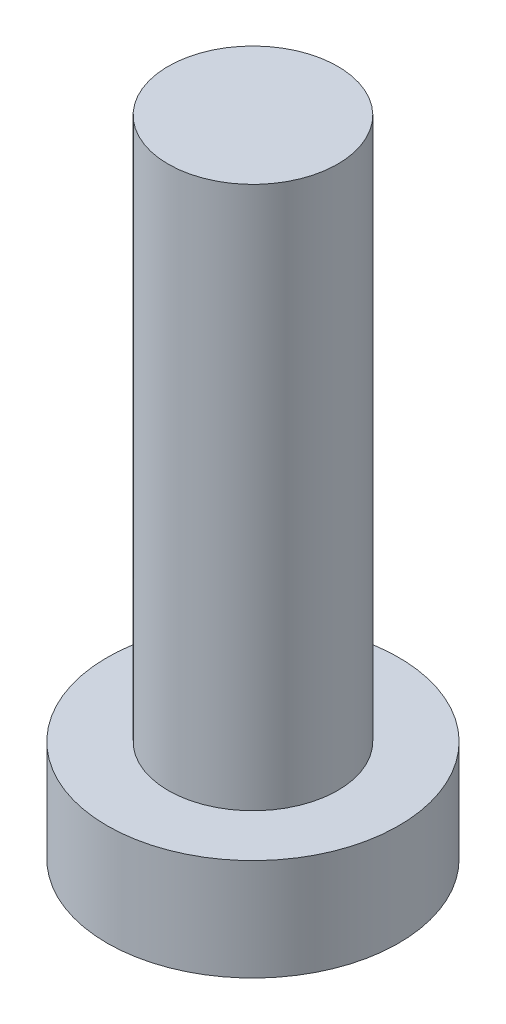
ISO-10303-21;
HEADER;
FILE_DESCRIPTION(('STEP AP214'),'2;1');
FILE_NAME('part.step','',(''),(''),'','','');
FILE_SCHEMA(('AUTOMOTIVE_DESIGN { 1 0 10303 214 1 1 1 1 }'));
ENDSEC;
DATA;
#1=APPLICATION_CONTEXT('core data for automotive mechanical design processes');
#2=APPLICATION_PROTOCOL_DEFINITION('international standard','automotive_design',2000,#1);
#3=PRODUCT_CONTEXT('',#1,'mechanical');
#4=PRODUCT('Part','Part','',(#3));
#5=PRODUCT_RELATED_PRODUCT_CATEGORY('part','',(#4));
#6=PRODUCT_DEFINITION_FORMATION('','',#4);
#7=PRODUCT_DEFINITION_CONTEXT('part definition',#1,'design');
#8=PRODUCT_DEFINITION('design','',#6,#7);
#9=PRODUCT_DEFINITION_SHAPE('','',#8);
#10=(LENGTH_UNIT() NAMED_UNIT(*) SI_UNIT(.MILLI.,.METRE.));
#11=(NAMED_UNIT(*) PLANE_ANGLE_UNIT() SI_UNIT($,.RADIAN.));
#12=(NAMED_UNIT(*) SI_UNIT($,.STERADIAN.) SOLID_ANGLE_UNIT());
#13=UNCERTAINTY_MEASURE_WITH_UNIT(LENGTH_MEASURE(1.E-05),#10,'distance_accuracy_value','');
#14=(GEOMETRIC_REPRESENTATION_CONTEXT(3) GLOBAL_UNCERTAINTY_ASSIGNED_CONTEXT((#13)) GLOBAL_UNIT_ASSIGNED_CONTEXT((#10,
#11,#12)) REPRESENTATION_CONTEXT('',''));
#15=CARTESIAN_POINT('',(0.,0.,0.));
#16=DIRECTION('',(0.,0.,1.));
#17=DIRECTION('',(1.,0.,0.));
#18=AXIS2_PLACEMENT_3D('',#15,#16,#17);
#19=CARTESIAN_POINT('',(0.,0.,0.));
#20=DIRECTION('',(0.,1.,0.));
#21=DIRECTION('',(0.,0.,1.));
#22=AXIS2_PLACEMENT_3D('',#19,#20,#21);
#23=PLANE('',#22);
#24=CARTESIAN_POINT('',(0.,0.,0.));
#25=DIRECTION('',(0.,1.,0.));
#26=DIRECTION('',(0.,0.,1.));
#27=AXIS2_PLACEMENT_3D('',#24,#25,#26);
#28=CIRCLE('',#27,4.3);
#29=CARTESIAN_POINT('',(0.,0.,4.3));
#30=VERTEX_POINT('',#29);
#31=EDGE_CURVE('E39',#30,#30,#28,.T.);
#32=ORIENTED_EDGE('',*,*,#31,.F.);
#33=EDGE_LOOP('',(#32));
#34=FACE_BOUND('',#33,.T.);
#35=CARTESIAN_POINT('',(1.1,0.,1.1));
#36=DIRECTION('',(0.,1.,0.));
#37=DIRECTION('',(0.,0.,-1.));
#38=AXIS2_PLACEMENT_3D('',#35,#36,#37);
#39=CIRCLE('',#38,0.5);
#40=CARTESIAN_POINT('',(1.1,0.,0.6));
#41=VERTEX_POINT('',#40);
#42=CARTESIAN_POINT('',(0.6,0.,1.1));
#43=VERTEX_POINT('',#42);
#44=EDGE_CURVE('E186',#41,#43,#39,.T.);
#45=ORIENTED_EDGE('',*,*,#44,.F.);
#46=DIRECTION('',(-1.,0.,0.));
#47=VECTOR('',#46,1.);
#48=CARTESIAN_POINT('',(1.1,0.,0.6));
#49=LINE('',#48,#47);
#50=CARTESIAN_POINT('',(2.4,0.,0.6));
#51=VERTEX_POINT('',#50);
#52=EDGE_CURVE('E52',#51,#41,#49,.T.);
#53=ORIENTED_EDGE('',*,*,#52,.F.);
#54=DIRECTION('',(0.,0.,1.));
#55=VECTOR('',#54,1.);
#56=CARTESIAN_POINT('',(2.4,0.,-0.6));
#57=LINE('',#56,#55);
#58=CARTESIAN_POINT('',(2.4,0.,-0.6));
#59=VERTEX_POINT('',#58);
#60=EDGE_CURVE('E225',#59,#51,#57,.T.);
#61=ORIENTED_EDGE('',*,*,#60,.F.);
#62=DIRECTION('',(1.,0.,0.));
#63=VECTOR('',#62,1.);
#64=CARTESIAN_POINT('',(1.1,0.,-0.6));
#65=LINE('',#64,#63);
#66=CARTESIAN_POINT('',(1.1,0.,-0.6));
#67=VERTEX_POINT('',#66);
#68=EDGE_CURVE('E223',#67,#59,#65,.T.);
#69=ORIENTED_EDGE('',*,*,#68,.F.);
#70=CARTESIAN_POINT('',(1.1,0.,-1.1));
#71=DIRECTION('',(0.,1.,0.));
#72=DIRECTION('',(0.,0.,-1.));
#73=AXIS2_PLACEMENT_3D('',#70,#71,#72);
#74=CIRCLE('',#73,0.5);
#75=CARTESIAN_POINT('',(0.600000000000001,0.,-1.1));
#76=VERTEX_POINT('',#75);
#77=EDGE_CURVE('E160',#76,#67,#74,.T.);
#78=ORIENTED_EDGE('',*,*,#77,.F.);
#79=DIRECTION('',(0.,0.,1.));
#80=VECTOR('',#79,1.);
#81=CARTESIAN_POINT('',(0.600000000000001,0.,-2.4));
#82=LINE('',#81,#80);
#83=CARTESIAN_POINT('',(0.600000000000001,0.,-2.4));
#84=VERTEX_POINT('',#83);
#85=EDGE_CURVE('E219',#84,#76,#82,.T.);
#86=ORIENTED_EDGE('',*,*,#85,.F.);
#87=DIRECTION('',(1.,0.,0.));
#88=VECTOR('',#87,1.);
#89=CARTESIAN_POINT('',(-0.599999999999999,0.,-2.4));
#90=LINE('',#89,#88);
#91=CARTESIAN_POINT('',(-0.599999999999999,0.,-2.4));
#92=VERTEX_POINT('',#91);
#93=EDGE_CURVE('E216',#92,#84,#90,.T.);
#94=ORIENTED_EDGE('',*,*,#93,.F.);
#95=DIRECTION('',(0.,0.,-1.));
#96=VECTOR('',#95,1.);
#97=CARTESIAN_POINT('',(-0.599999999999999,0.,-2.4));
#98=LINE('',#97,#96);
#99=CARTESIAN_POINT('',(-0.599999999999999,0.,-1.1));
#100=VERTEX_POINT('',#99);
#101=EDGE_CURVE('E213',#100,#92,#98,.T.);
#102=ORIENTED_EDGE('',*,*,#101,.F.);
#103=CARTESIAN_POINT('',(-1.1,0.,-1.1));
#104=DIRECTION('',(0.,1.,0.));
#105=DIRECTION('',(0.,0.,-1.));
#106=AXIS2_PLACEMENT_3D('',#103,#104,#105);
#107=CIRCLE('',#106,0.5);
#108=CARTESIAN_POINT('',(-1.1,0.,-0.6));
#109=VERTEX_POINT('',#108);
#110=EDGE_CURVE('E210',#109,#100,#107,.T.);
#111=ORIENTED_EDGE('',*,*,#110,.F.);
#112=DIRECTION('',(1.,0.,0.));
#113=VECTOR('',#112,1.);
#114=CARTESIAN_POINT('',(-2.4,0.,-0.6));
#115=LINE('',#114,#113);
#116=CARTESIAN_POINT('',(-2.4,0.,-0.6));
#117=VERTEX_POINT('',#116);
#118=EDGE_CURVE('E207',#117,#109,#115,.T.);
#119=ORIENTED_EDGE('',*,*,#118,.F.);
#120=DIRECTION('',(0.,0.,-1.));
#121=VECTOR('',#120,1.);
#122=CARTESIAN_POINT('',(-2.4,0.,-0.6));
#123=LINE('',#122,#121);
#124=CARTESIAN_POINT('',(-2.4,0.,0.6));
#125=VERTEX_POINT('',#124);
#126=EDGE_CURVE('E204',#125,#117,#123,.T.);
#127=ORIENTED_EDGE('',*,*,#126,.F.);
#128=DIRECTION('',(-1.,0.,0.));
#129=VECTOR('',#128,1.);
#130=CARTESIAN_POINT('',(-2.4,0.,0.6));
#131=LINE('',#130,#129);
#132=CARTESIAN_POINT('',(-1.1,0.,0.6));
#133=VERTEX_POINT('',#132);
#134=EDGE_CURVE('E201',#133,#125,#131,.T.);
#135=ORIENTED_EDGE('',*,*,#134,.F.);
#136=CARTESIAN_POINT('',(-1.1,0.,1.1));
#137=DIRECTION('',(0.,1.,0.));
#138=DIRECTION('',(0.,0.,1.));
#139=AXIS2_PLACEMENT_3D('',#136,#137,#138);
#140=CIRCLE('',#139,0.5);
#141=CARTESIAN_POINT('',(-0.599999999999999,0.,1.1));
#142=VERTEX_POINT('',#141);
#143=EDGE_CURVE('E198',#142,#133,#140,.T.);
#144=ORIENTED_EDGE('',*,*,#143,.F.);
#145=DIRECTION('',(0.,0.,-1.));
#146=VECTOR('',#145,1.);
#147=CARTESIAN_POINT('',(-0.599999999999999,0.,1.1));
#148=LINE('',#147,#146);
#149=CARTESIAN_POINT('',(-0.599999999999999,0.,2.4));
#150=VERTEX_POINT('',#149);
#151=EDGE_CURVE('E195',#150,#142,#148,.T.);
#152=ORIENTED_EDGE('',*,*,#151,.F.);
#153=DIRECTION('',(-1.,0.,0.));
#154=VECTOR('',#153,1.);
#155=CARTESIAN_POINT('',(-0.599999999999999,0.,2.4));
#156=LINE('',#155,#154);
#157=CARTESIAN_POINT('',(0.600000000000001,0.,2.4));
#158=VERTEX_POINT('',#157);
#159=EDGE_CURVE('E192',#158,#150,#156,.T.);
#160=ORIENTED_EDGE('',*,*,#159,.F.);
#161=DIRECTION('',(0.,0.,1.));
#162=VECTOR('',#161,1.);
#163=CARTESIAN_POINT('',(0.6,0.,1.1));
#164=LINE('',#163,#162);
#165=EDGE_CURVE('E189',#43,#158,#164,.T.);
#166=ORIENTED_EDGE('',*,*,#165,.F.);
#167=EDGE_LOOP('',(#45,#53,#61,#69,#78,#86,#94,#102,#111,#119,#127,#135,#144,#152,#160,#166));
#168=FACE_BOUND('',#167,.T.);
#169=ADVANCED_FACE('F35',(#34,#168),#23,.F.);
#170=CARTESIAN_POINT('',(0.,3.,0.));
#171=DIRECTION('',(0.,-1.,0.));
#172=DIRECTION('',(0.,0.,-1.));
#173=AXIS2_PLACEMENT_3D('',#170,#171,#172);
#174=CYLINDRICAL_SURFACE('',#173,4.3);
#175=CARTESIAN_POINT('',(0.,3.,0.));
#176=DIRECTION('',(0.,1.,0.));
#177=DIRECTION('',(0.,0.,1.));
#178=AXIS2_PLACEMENT_3D('',#175,#176,#177);
#179=CIRCLE('',#178,4.3);
#180=CARTESIAN_POINT('',(0.,3.,4.3));
#181=VERTEX_POINT('',#180);
#182=EDGE_CURVE('E44',#181,#181,#179,.T.);
#183=ORIENTED_EDGE('',*,*,#182,.F.);
#184=EDGE_LOOP('',(#183));
#185=FACE_BOUND('',#184,.T.);
#186=ORIENTED_EDGE('',*,*,#31,.T.);
#187=EDGE_LOOP('',(#186));
#188=FACE_BOUND('',#187,.T.);
#189=ADVANCED_FACE('F37',(#185,#188),#174,.T.);
#190=CARTESIAN_POINT('',(0.,3.,0.));
#191=DIRECTION('',(0.,1.,0.));
#192=DIRECTION('',(0.,0.,1.));
#193=AXIS2_PLACEMENT_3D('',#190,#191,#192);
#194=PLANE('',#193);
#195=CARTESIAN_POINT('',(0.,3.,0.));
#196=DIRECTION('',(0.,1.,0.));
#197=DIRECTION('',(0.,0.,1.));
#198=AXIS2_PLACEMENT_3D('',#195,#196,#197);
#199=CIRCLE('',#198,2.5);
#200=CARTESIAN_POINT('',(0.,3.,2.5));
#201=VERTEX_POINT('',#200);
#202=EDGE_CURVE('E11',#201,#201,#199,.T.);
#203=ORIENTED_EDGE('',*,*,#202,.F.);
#204=EDGE_LOOP('',(#203));
#205=FACE_BOUND('',#204,.T.);
#206=ORIENTED_EDGE('',*,*,#182,.T.);
#207=EDGE_LOOP('',(#206));
#208=FACE_BOUND('',#207,.T.);
#209=ADVANCED_FACE('F374',(#205,#208),#194,.T.);
#210=CARTESIAN_POINT('',(0.,19.,0.));
#211=DIRECTION('',(0.,-1.,0.));
#212=DIRECTION('',(0.,0.,-1.));
#213=AXIS2_PLACEMENT_3D('',#210,#211,#212);
#214=CYLINDRICAL_SURFACE('',#213,2.5);
#215=CARTESIAN_POINT('',(0.,19.,0.));
#216=DIRECTION('',(0.,1.,0.));
#217=DIRECTION('',(0.,0.,1.));
#218=AXIS2_PLACEMENT_3D('',#215,#216,#217);
#219=CIRCLE('',#218,2.5);
#220=CARTESIAN_POINT('',(0.,19.,2.5));
#221=VERTEX_POINT('',#220);
#222=EDGE_CURVE('E229',#221,#221,#219,.T.);
#223=ORIENTED_EDGE('',*,*,#222,.F.);
#224=EDGE_LOOP('',(#223));
#225=FACE_BOUND('',#224,.T.);
#226=ORIENTED_EDGE('',*,*,#202,.T.);
#227=EDGE_LOOP('',(#226));
#228=FACE_BOUND('',#227,.T.);
#229=ADVANCED_FACE('F370',(#225,#228),#214,.T.);
#230=CARTESIAN_POINT('',(0.,19.,0.));
#231=DIRECTION('',(0.,1.,0.));
#232=DIRECTION('',(0.,0.,1.));
#233=AXIS2_PLACEMENT_3D('',#230,#231,#232);
#234=PLANE('',#233);
#235=ORIENTED_EDGE('',*,*,#222,.T.);
#236=EDGE_LOOP('',(#235));
#237=FACE_BOUND('',#236,.T.);
#238=ADVANCED_FACE('F320',(#237),#234,.T.);
#239=CARTESIAN_POINT('',(1.1,1.5,0.6));
#240=DIRECTION('',(0.,0.,1.));
#241=DIRECTION('',(1.,0.,0.));
#242=AXIS2_PLACEMENT_3D('',#239,#240,#241);
#243=PLANE('',#242);
#244=ORIENTED_EDGE('',*,*,#52,.T.);
#245=DIRECTION('',(0.,-1.,0.));
#246=VECTOR('',#245,1.);
#247=CARTESIAN_POINT('',(1.1,1.5,0.6));
#248=LINE('',#247,#246);
#249=CARTESIAN_POINT('',(1.1,1.5,0.6));
#250=VERTEX_POINT('',#249);
#251=EDGE_CURVE('E112',#250,#41,#248,.T.);
#252=ORIENTED_EDGE('',*,*,#251,.F.);
#253=DIRECTION('',(-1.,0.,0.));
#254=VECTOR('',#253,1.);
#255=CARTESIAN_POINT('',(1.1,1.5,0.6));
#256=LINE('',#255,#254);
#257=CARTESIAN_POINT('',(2.4,1.5,0.6));
#258=VERTEX_POINT('',#257);
#259=EDGE_CURVE('E227',#258,#250,#256,.T.);
#260=ORIENTED_EDGE('',*,*,#259,.F.);
#261=DIRECTION('',(0.,-1.,0.));
#262=VECTOR('',#261,1.);
#263=CARTESIAN_POINT('',(2.4,1.5,0.6));
#264=LINE('',#263,#262);
#265=EDGE_CURVE('E60',#258,#51,#264,.T.);
#266=ORIENTED_EDGE('',*,*,#265,.T.);
#267=EDGE_LOOP('',(#244,#252,#260,#266));
#268=FACE_BOUND('',#267,.T.);
#269=ADVANCED_FACE('F313',(#268),#243,.F.);
#270=CARTESIAN_POINT('',(2.4,1.5,-0.6));
#271=DIRECTION('',(1.,0.,0.));
#272=DIRECTION('',(0.,0.,-1.));
#273=AXIS2_PLACEMENT_3D('',#270,#271,#272);
#274=PLANE('',#273);
#275=ORIENTED_EDGE('',*,*,#60,.T.);
#276=ORIENTED_EDGE('',*,*,#265,.F.);
#277=DIRECTION('',(0.,0.,1.));
#278=VECTOR('',#277,1.);
#279=CARTESIAN_POINT('',(2.4,1.5,-0.6));
#280=LINE('',#279,#278);
#281=CARTESIAN_POINT('',(2.4,1.5,-0.6));
#282=VERTEX_POINT('',#281);
#283=EDGE_CURVE('E172',#282,#258,#280,.T.);
#284=ORIENTED_EDGE('',*,*,#283,.F.);
#285=DIRECTION('',(0.,-1.,0.));
#286=VECTOR('',#285,1.);
#287=CARTESIAN_POINT('',(2.4,1.5,-0.6));
#288=LINE('',#287,#286);
#289=EDGE_CURVE('E164',#282,#59,#288,.T.);
#290=ORIENTED_EDGE('',*,*,#289,.T.);
#291=EDGE_LOOP('',(#275,#276,#284,#290));
#292=FACE_BOUND('',#291,.T.);
#293=ADVANCED_FACE('F311',(#292),#274,.F.);
#294=CARTESIAN_POINT('',(1.1,1.5,-0.6));
#295=DIRECTION('',(0.,0.,-1.));
#296=DIRECTION('',(-1.,0.,0.));
#297=AXIS2_PLACEMENT_3D('',#294,#295,#296);
#298=PLANE('',#297);
#299=ORIENTED_EDGE('',*,*,#68,.T.);
#300=ORIENTED_EDGE('',*,*,#289,.F.);
#301=DIRECTION('',(1.,0.,0.));
#302=VECTOR('',#301,1.);
#303=CARTESIAN_POINT('',(1.1,1.5,-0.6));
#304=LINE('',#303,#302);
#305=CARTESIAN_POINT('',(1.1,1.5,-0.6));
#306=VERTEX_POINT('',#305);
#307=EDGE_CURVE('E168',#306,#282,#304,.T.);
#308=ORIENTED_EDGE('',*,*,#307,.F.);
#309=DIRECTION('',(0.,-1.,0.));
#310=VECTOR('',#309,1.);
#311=CARTESIAN_POINT('',(1.1,1.5,-0.6));
#312=LINE('',#311,#310);
#313=EDGE_CURVE('E153',#306,#67,#312,.T.);
#314=ORIENTED_EDGE('',*,*,#313,.T.);
#315=EDGE_LOOP('',(#299,#300,#308,#314));
#316=FACE_BOUND('',#315,.T.);
#317=ADVANCED_FACE('F169',(#316),#298,.F.);
#318=CARTESIAN_POINT('',(1.1,1.5,-1.1));
#319=DIRECTION('',(0.,-1.,0.));
#320=DIRECTION('',(0.,0.,-1.));
#321=AXIS2_PLACEMENT_3D('',#318,#319,#320);
#322=CYLINDRICAL_SURFACE('',#321,0.5);
#323=ORIENTED_EDGE('',*,*,#77,.T.);
#324=ORIENTED_EDGE('',*,*,#313,.F.);
#325=CARTESIAN_POINT('',(1.1,1.5,-1.1));
#326=DIRECTION('',(0.,1.,0.));
#327=DIRECTION('',(0.,0.,-1.));
#328=AXIS2_PLACEMENT_3D('',#325,#326,#327);
#329=CIRCLE('',#328,0.5);
#330=CARTESIAN_POINT('',(0.600000000000001,1.5,-1.1));
#331=VERTEX_POINT('',#330);
#332=EDGE_CURVE('E157',#331,#306,#329,.T.);
#333=ORIENTED_EDGE('',*,*,#332,.F.);
#334=DIRECTION('',(0.,-1.,0.));
#335=VECTOR('',#334,1.);
#336=CARTESIAN_POINT('',(0.600000000000001,1.5,-1.1));
#337=LINE('',#336,#335);
#338=EDGE_CURVE('E165',#331,#76,#337,.T.);
#339=ORIENTED_EDGE('',*,*,#338,.T.);
#340=EDGE_LOOP('',(#323,#324,#333,#339));
#341=FACE_BOUND('',#340,.T.);
#342=ADVANCED_FACE('F155',(#341),#322,.T.);
#343=CARTESIAN_POINT('',(0.600000000000001,1.5,-2.4));
#344=DIRECTION('',(1.,0.,0.));
#345=DIRECTION('',(0.,0.,-1.));
#346=AXIS2_PLACEMENT_3D('',#343,#344,#345);
#347=PLANE('',#346);
#348=ORIENTED_EDGE('',*,*,#85,.T.);
#349=ORIENTED_EDGE('',*,*,#338,.F.);
#350=DIRECTION('',(0.,0.,1.));
#351=VECTOR('',#350,1.);
#352=CARTESIAN_POINT('',(0.600000000000001,1.5,-2.4));
#353=LINE('',#352,#351);
#354=CARTESIAN_POINT('',(0.600000000000001,1.5,-2.4));
#355=VERTEX_POINT('',#354);
#356=EDGE_CURVE('E178',#355,#331,#353,.T.);
#357=ORIENTED_EDGE('',*,*,#356,.F.);
#358=DIRECTION('',(0.,-1.,0.));
#359=VECTOR('',#358,1.);
#360=CARTESIAN_POINT('',(0.600000000000001,1.5,-2.4));
#361=LINE('',#360,#359);
#362=EDGE_CURVE('E232',#355,#84,#361,.T.);
#363=ORIENTED_EDGE('',*,*,#362,.T.);
#364=EDGE_LOOP('',(#348,#349,#357,#363));
#365=FACE_BOUND('',#364,.T.);
#366=ADVANCED_FACE('F310',(#365),#347,.F.);
#367=CARTESIAN_POINT('',(-0.599999999999999,1.5,-2.4));
#368=DIRECTION('',(0.,0.,-1.));
#369=DIRECTION('',(-1.,0.,0.));
#370=AXIS2_PLACEMENT_3D('',#367,#368,#369);
#371=PLANE('',#370);
#372=ORIENTED_EDGE('',*,*,#93,.T.);
#373=ORIENTED_EDGE('',*,*,#362,.F.);
#374=DIRECTION('',(1.,0.,0.));
#375=VECTOR('',#374,1.);
#376=CARTESIAN_POINT('',(-0.599999999999999,1.5,-2.4));
#377=LINE('',#376,#375);
#378=CARTESIAN_POINT('',(-0.599999999999999,1.5,-2.4));
#379=VERTEX_POINT('',#378);
#380=EDGE_CURVE('E180',#379,#355,#377,.T.);
#381=ORIENTED_EDGE('',*,*,#380,.F.);
#382=DIRECTION('',(0.,-1.,0.));
#383=VECTOR('',#382,1.);
#384=CARTESIAN_POINT('',(-0.599999999999999,1.5,-2.4));
#385=LINE('',#384,#383);
#386=EDGE_CURVE('E234',#379,#92,#385,.T.);
#387=ORIENTED_EDGE('',*,*,#386,.T.);
#388=EDGE_LOOP('',(#372,#373,#381,#387));
#389=FACE_BOUND('',#388,.T.);
#390=ADVANCED_FACE('F306',(#389),#371,.F.);
#391=CARTESIAN_POINT('',(-0.599999999999999,1.5,-2.4));
#392=DIRECTION('',(-1.,0.,0.));
#393=DIRECTION('',(0.,0.,1.));
#394=AXIS2_PLACEMENT_3D('',#391,#392,#393);
#395=PLANE('',#394);
#396=ORIENTED_EDGE('',*,*,#101,.T.);
#397=ORIENTED_EDGE('',*,*,#386,.F.);
#398=DIRECTION('',(0.,0.,-1.));
#399=VECTOR('',#398,1.);
#400=CARTESIAN_POINT('',(-0.599999999999999,1.5,-2.4));
#401=LINE('',#400,#399);
#402=CARTESIAN_POINT('',(-0.599999999999999,1.5,-1.1));
#403=VERTEX_POINT('',#402);
#404=EDGE_CURVE('E301',#403,#379,#401,.T.);
#405=ORIENTED_EDGE('',*,*,#404,.F.);
#406=DIRECTION('',(0.,-1.,0.));
#407=VECTOR('',#406,1.);
#408=CARTESIAN_POINT('',(-0.599999999999999,1.5,-1.1));
#409=LINE('',#408,#407);
#410=EDGE_CURVE('E236',#403,#100,#409,.T.);
#411=ORIENTED_EDGE('',*,*,#410,.T.);
#412=EDGE_LOOP('',(#396,#397,#405,#411));
#413=FACE_BOUND('',#412,.T.);
#414=ADVANCED_FACE('F330',(#413),#395,.F.);
#415=CARTESIAN_POINT('',(-1.1,1.5,-1.1));
#416=DIRECTION('',(0.,-1.,0.));
#417=DIRECTION('',(0.,0.,-1.));
#418=AXIS2_PLACEMENT_3D('',#415,#416,#417);
#419=CYLINDRICAL_SURFACE('',#418,0.5);
#420=ORIENTED_EDGE('',*,*,#110,.T.);
#421=ORIENTED_EDGE('',*,*,#410,.F.);
#422=CARTESIAN_POINT('',(-1.1,1.5,-1.1));
#423=DIRECTION('',(0.,1.,0.));
#424=DIRECTION('',(0.,0.,-1.));
#425=AXIS2_PLACEMENT_3D('',#422,#423,#424);
#426=CIRCLE('',#425,0.5);
#427=CARTESIAN_POINT('',(-1.1,1.5,-0.6));
#428=VERTEX_POINT('',#427);
#429=EDGE_CURVE('E298',#428,#403,#426,.T.);
#430=ORIENTED_EDGE('',*,*,#429,.F.);
#431=DIRECTION('',(0.,-1.,0.));
#432=VECTOR('',#431,1.);
#433=CARTESIAN_POINT('',(-1.1,1.5,-0.6));
#434=LINE('',#433,#432);
#435=EDGE_CURVE('E238',#428,#109,#434,.T.);
#436=ORIENTED_EDGE('',*,*,#435,.T.);
#437=EDGE_LOOP('',(#420,#421,#430,#436));
#438=FACE_BOUND('',#437,.T.);
#439=ADVANCED_FACE('F333',(#438),#419,.T.);
#440=CARTESIAN_POINT('',(-2.4,1.5,-0.6));
#441=DIRECTION('',(0.,0.,-1.));
#442=DIRECTION('',(-1.,0.,0.));
#443=AXIS2_PLACEMENT_3D('',#440,#441,#442);
#444=PLANE('',#443);
#445=ORIENTED_EDGE('',*,*,#118,.T.);
#446=ORIENTED_EDGE('',*,*,#435,.F.);
#447=DIRECTION('',(1.,0.,0.));
#448=VECTOR('',#447,1.);
#449=CARTESIAN_POINT('',(-2.4,1.5,-0.6));
#450=LINE('',#449,#448);
#451=CARTESIAN_POINT('',(-2.4,1.5,-0.6));
#452=VERTEX_POINT('',#451);
#453=EDGE_CURVE('E295',#452,#428,#450,.T.);
#454=ORIENTED_EDGE('',*,*,#453,.F.);
#455=DIRECTION('',(0.,-1.,0.));
#456=VECTOR('',#455,1.);
#457=CARTESIAN_POINT('',(-2.4,1.5,-0.6));
#458=LINE('',#457,#456);
#459=EDGE_CURVE('E240',#452,#117,#458,.T.);
#460=ORIENTED_EDGE('',*,*,#459,.T.);
#461=EDGE_LOOP('',(#445,#446,#454,#460));
#462=FACE_BOUND('',#461,.T.);
#463=ADVANCED_FACE('F337',(#462),#444,.F.);
#464=CARTESIAN_POINT('',(-2.4,1.5,-0.6));
#465=DIRECTION('',(-1.,0.,0.));
#466=DIRECTION('',(0.,0.,1.));
#467=AXIS2_PLACEMENT_3D('',#464,#465,#466);
#468=PLANE('',#467);
#469=ORIENTED_EDGE('',*,*,#126,.T.);
#470=ORIENTED_EDGE('',*,*,#459,.F.);
#471=DIRECTION('',(0.,0.,-1.));
#472=VECTOR('',#471,1.);
#473=CARTESIAN_POINT('',(-2.4,1.5,-0.6));
#474=LINE('',#473,#472);
#475=CARTESIAN_POINT('',(-2.4,1.5,0.6));
#476=VERTEX_POINT('',#475);
#477=EDGE_CURVE('E292',#476,#452,#474,.T.);
#478=ORIENTED_EDGE('',*,*,#477,.F.);
#479=DIRECTION('',(0.,-1.,0.));
#480=VECTOR('',#479,1.);
#481=CARTESIAN_POINT('',(-2.4,1.5,0.6));
#482=LINE('',#481,#480);
#483=EDGE_CURVE('E242',#476,#125,#482,.T.);
#484=ORIENTED_EDGE('',*,*,#483,.T.);
#485=EDGE_LOOP('',(#469,#470,#478,#484));
#486=FACE_BOUND('',#485,.T.);
#487=ADVANCED_FACE('F341',(#486),#468,.F.);
#488=CARTESIAN_POINT('',(-2.4,1.5,0.6));
#489=DIRECTION('',(0.,0.,1.));
#490=DIRECTION('',(1.,0.,0.));
#491=AXIS2_PLACEMENT_3D('',#488,#489,#490);
#492=PLANE('',#491);
#493=ORIENTED_EDGE('',*,*,#134,.T.);
#494=ORIENTED_EDGE('',*,*,#483,.F.);
#495=DIRECTION('',(-1.,0.,0.));
#496=VECTOR('',#495,1.);
#497=CARTESIAN_POINT('',(-2.4,1.5,0.6));
#498=LINE('',#497,#496);
#499=CARTESIAN_POINT('',(-1.1,1.5,0.6));
#500=VERTEX_POINT('',#499);
#501=EDGE_CURVE('E289',#500,#476,#498,.T.);
#502=ORIENTED_EDGE('',*,*,#501,.F.);
#503=DIRECTION('',(0.,-1.,0.));
#504=VECTOR('',#503,1.);
#505=CARTESIAN_POINT('',(-1.1,1.5,0.6));
#506=LINE('',#505,#504);
#507=EDGE_CURVE('E244',#500,#133,#506,.T.);
#508=ORIENTED_EDGE('',*,*,#507,.T.);
#509=EDGE_LOOP('',(#493,#494,#502,#508));
#510=FACE_BOUND('',#509,.T.);
#511=ADVANCED_FACE('F345',(#510),#492,.F.);
#512=CARTESIAN_POINT('',(-1.1,1.5,1.1));
#513=DIRECTION('',(0.,-1.,0.));
#514=DIRECTION('',(0.,0.,-1.));
#515=AXIS2_PLACEMENT_3D('',#512,#513,#514);
#516=CYLINDRICAL_SURFACE('',#515,0.5);
#517=ORIENTED_EDGE('',*,*,#143,.T.);
#518=ORIENTED_EDGE('',*,*,#507,.F.);
#519=CARTESIAN_POINT('',(-1.1,1.5,1.1));
#520=DIRECTION('',(0.,1.,0.));
#521=DIRECTION('',(0.,0.,1.));
#522=AXIS2_PLACEMENT_3D('',#519,#520,#521);
#523=CIRCLE('',#522,0.5);
#524=CARTESIAN_POINT('',(-0.599999999999999,1.5,1.1));
#525=VERTEX_POINT('',#524);
#526=EDGE_CURVE('E286',#525,#500,#523,.T.);
#527=ORIENTED_EDGE('',*,*,#526,.F.);
#528=DIRECTION('',(0.,-1.,0.));
#529=VECTOR('',#528,1.);
#530=CARTESIAN_POINT('',(-0.599999999999999,1.5,1.1));
#531=LINE('',#530,#529);
#532=EDGE_CURVE('E246',#525,#142,#531,.T.);
#533=ORIENTED_EDGE('',*,*,#532,.T.);
#534=EDGE_LOOP('',(#517,#518,#527,#533));
#535=FACE_BOUND('',#534,.T.);
#536=ADVANCED_FACE('F349',(#535),#516,.T.);
#537=CARTESIAN_POINT('',(-0.599999999999999,1.5,1.1));
#538=DIRECTION('',(-1.,0.,0.));
#539=DIRECTION('',(0.,0.,1.));
#540=AXIS2_PLACEMENT_3D('',#537,#538,#539);
#541=PLANE('',#540);
#542=ORIENTED_EDGE('',*,*,#151,.T.);
#543=ORIENTED_EDGE('',*,*,#532,.F.);
#544=DIRECTION('',(0.,0.,-1.));
#545=VECTOR('',#544,1.);
#546=CARTESIAN_POINT('',(-0.599999999999999,1.5,1.1));
#547=LINE('',#546,#545);
#548=CARTESIAN_POINT('',(-0.599999999999999,1.5,2.4));
#549=VERTEX_POINT('',#548);
#550=EDGE_CURVE('E283',#549,#525,#547,.T.);
#551=ORIENTED_EDGE('',*,*,#550,.F.);
#552=DIRECTION('',(0.,-1.,0.));
#553=VECTOR('',#552,1.);
#554=CARTESIAN_POINT('',(-0.599999999999999,1.5,2.4));
#555=LINE('',#554,#553);
#556=EDGE_CURVE('E248',#549,#150,#555,.T.);
#557=ORIENTED_EDGE('',*,*,#556,.T.);
#558=EDGE_LOOP('',(#542,#543,#551,#557));
#559=FACE_BOUND('',#558,.T.);
#560=ADVANCED_FACE('F353',(#559),#541,.F.);
#561=CARTESIAN_POINT('',(-0.599999999999999,1.5,2.4));
#562=DIRECTION('',(0.,0.,1.));
#563=DIRECTION('',(1.,0.,0.));
#564=AXIS2_PLACEMENT_3D('',#561,#562,#563);
#565=PLANE('',#564);
#566=ORIENTED_EDGE('',*,*,#159,.T.);
#567=ORIENTED_EDGE('',*,*,#556,.F.);
#568=DIRECTION('',(-1.,0.,0.));
#569=VECTOR('',#568,1.);
#570=CARTESIAN_POINT('',(-0.599999999999999,1.5,2.4));
#571=LINE('',#570,#569);
#572=CARTESIAN_POINT('',(0.600000000000001,1.5,2.4));
#573=VERTEX_POINT('',#572);
#574=EDGE_CURVE('E280',#573,#549,#571,.T.);
#575=ORIENTED_EDGE('',*,*,#574,.F.);
#576=DIRECTION('',(0.,-1.,0.));
#577=VECTOR('',#576,1.);
#578=CARTESIAN_POINT('',(0.600000000000001,1.5,2.4));
#579=LINE('',#578,#577);
#580=EDGE_CURVE('E250',#573,#158,#579,.T.);
#581=ORIENTED_EDGE('',*,*,#580,.T.);
#582=EDGE_LOOP('',(#566,#567,#575,#581));
#583=FACE_BOUND('',#582,.T.);
#584=ADVANCED_FACE('F357',(#583),#565,.F.);
#585=CARTESIAN_POINT('',(0.6,1.5,1.1));
#586=DIRECTION('',(1.,0.,0.));
#587=DIRECTION('',(0.,0.,-1.));
#588=AXIS2_PLACEMENT_3D('',#585,#586,#587);
#589=PLANE('',#588);
#590=ORIENTED_EDGE('',*,*,#165,.T.);
#591=ORIENTED_EDGE('',*,*,#580,.F.);
#592=DIRECTION('',(0.,0.,1.));
#593=VECTOR('',#592,1.);
#594=CARTESIAN_POINT('',(0.6,1.5,1.1));
#595=LINE('',#594,#593);
#596=CARTESIAN_POINT('',(0.6,1.5,1.1));
#597=VERTEX_POINT('',#596);
#598=EDGE_CURVE('E275',#597,#573,#595,.T.);
#599=ORIENTED_EDGE('',*,*,#598,.F.);
#600=DIRECTION('',(0.,-1.,0.));
#601=VECTOR('',#600,1.);
#602=CARTESIAN_POINT('',(0.6,1.5,1.1));
#603=LINE('',#602,#601);
#604=EDGE_CURVE('E252',#597,#43,#603,.T.);
#605=ORIENTED_EDGE('',*,*,#604,.T.);
#606=EDGE_LOOP('',(#590,#591,#599,#605));
#607=FACE_BOUND('',#606,.T.);
#608=ADVANCED_FACE('F361',(#607),#589,.F.);
#609=CARTESIAN_POINT('',(1.1,1.5,1.1));
#610=DIRECTION('',(0.,-1.,0.));
#611=DIRECTION('',(0.,0.,-1.));
#612=AXIS2_PLACEMENT_3D('',#609,#610,#611);
#613=CYLINDRICAL_SURFACE('',#612,0.5);
#614=ORIENTED_EDGE('',*,*,#44,.T.);
#615=ORIENTED_EDGE('',*,*,#604,.F.);
#616=CARTESIAN_POINT('',(1.1,1.5,1.1));
#617=DIRECTION('',(0.,1.,0.));
#618=DIRECTION('',(0.,0.,-1.));
#619=AXIS2_PLACEMENT_3D('',#616,#617,#618);
#620=CIRCLE('',#619,0.5);
#621=EDGE_CURVE('E273',#250,#597,#620,.T.);
#622=ORIENTED_EDGE('',*,*,#621,.F.);
#623=ORIENTED_EDGE('',*,*,#251,.T.);
#624=EDGE_LOOP('',(#614,#615,#622,#623));
#625=FACE_BOUND('',#624,.T.);
#626=ADVANCED_FACE('F270',(#625),#613,.T.);
#627=CARTESIAN_POINT('',(1.1,1.5,-1.1));
#628=DIRECTION('',(0.,-1.,0.));
#629=DIRECTION('',(0.,0.,-1.));
#630=AXIS2_PLACEMENT_3D('',#627,#628,#629);
#631=PLANE('',#630);
#632=ORIENTED_EDGE('',*,*,#259,.T.);
#633=ORIENTED_EDGE('',*,*,#621,.T.);
#634=ORIENTED_EDGE('',*,*,#598,.T.);
#635=ORIENTED_EDGE('',*,*,#574,.T.);
#636=ORIENTED_EDGE('',*,*,#550,.T.);
#637=ORIENTED_EDGE('',*,*,#526,.T.);
#638=ORIENTED_EDGE('',*,*,#501,.T.);
#639=ORIENTED_EDGE('',*,*,#477,.T.);
#640=ORIENTED_EDGE('',*,*,#453,.T.);
#641=ORIENTED_EDGE('',*,*,#429,.T.);
#642=ORIENTED_EDGE('',*,*,#404,.T.);
#643=ORIENTED_EDGE('',*,*,#380,.T.);
#644=ORIENTED_EDGE('',*,*,#356,.T.);
#645=ORIENTED_EDGE('',*,*,#332,.T.);
#646=ORIENTED_EDGE('',*,*,#307,.T.);
#647=ORIENTED_EDGE('',*,*,#283,.T.);
#648=EDGE_LOOP('',(#632,#633,#634,#635,#636,#637,#638,#639,#640,#641,#642,#643,#644,#645,#646,#647));
#649=FACE_BOUND('',#648,.T.);
#650=ADVANCED_FACE('F175',(#649),#631,.T.);
#651=CLOSED_SHELL('',(#169,#189,#209,#229,#238,#269,#293,#317,#342,#366,#390,#414,#439,#463,
#487,#511,#536,#560,#584,#608,#626,#650));
#652=MANIFOLD_SOLID_BREP('B2',#651);
#653=ADVANCED_BREP_SHAPE_REPRESENTATION('',(#18,#652),#14);
#654=SHAPE_DEFINITION_REPRESENTATION(#9,#653);
ENDSEC;
END-ISO-10303-21;
